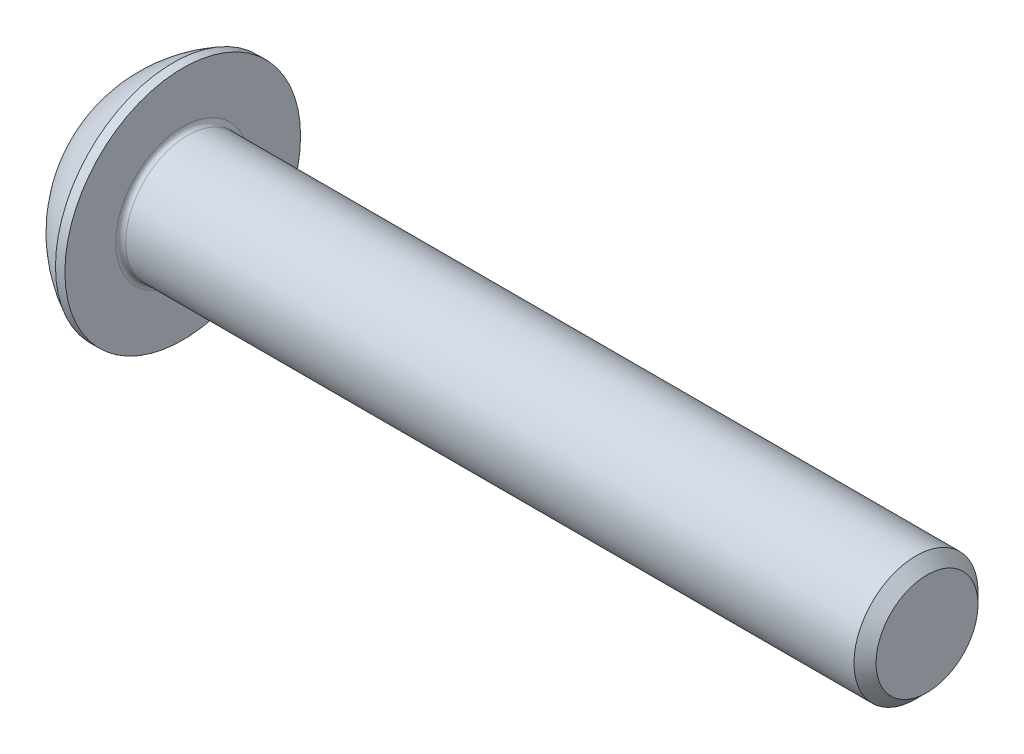
ISO-10303-21;
HEADER;
FILE_DESCRIPTION(('STEP AP214'),'2;1');
FILE_NAME('part.step','',(''),(''),'','','');
FILE_SCHEMA(('AUTOMOTIVE_DESIGN { 1 0 10303 214 1 1 1 1 }'));
ENDSEC;
DATA;
#1=APPLICATION_CONTEXT('core data for automotive mechanical design processes');
#2=APPLICATION_PROTOCOL_DEFINITION('international standard','automotive_design',2000,#1);
#3=PRODUCT_CONTEXT('',#1,'mechanical');
#4=PRODUCT('Part','Part','',(#3));
#5=PRODUCT_RELATED_PRODUCT_CATEGORY('part','',(#4));
#6=PRODUCT_DEFINITION_FORMATION('','',#4);
#7=PRODUCT_DEFINITION_CONTEXT('part definition',#1,'design');
#8=PRODUCT_DEFINITION('design','',#6,#7);
#9=PRODUCT_DEFINITION_SHAPE('','',#8);
#10=(LENGTH_UNIT() NAMED_UNIT(*) SI_UNIT(.MILLI.,.METRE.));
#11=(NAMED_UNIT(*) PLANE_ANGLE_UNIT() SI_UNIT($,.RADIAN.));
#12=(NAMED_UNIT(*) SI_UNIT($,.STERADIAN.) SOLID_ANGLE_UNIT());
#13=UNCERTAINTY_MEASURE_WITH_UNIT(LENGTH_MEASURE(1.E-05),#10,'distance_accuracy_value','');
#14=(GEOMETRIC_REPRESENTATION_CONTEXT(3) GLOBAL_UNCERTAINTY_ASSIGNED_CONTEXT((#13)) GLOBAL_UNIT_ASSIGNED_CONTEXT((#10,
#11,#12)) REPRESENTATION_CONTEXT('',''));
#15=CARTESIAN_POINT('',(0.,0.,0.));
#16=DIRECTION('',(0.,0.,1.));
#17=DIRECTION('',(1.,0.,0.));
#18=AXIS2_PLACEMENT_3D('',#15,#16,#17);
#19=CARTESIAN_POINT('',(0.,0.,0.));
#20=DIRECTION('',(-1.,0.,0.));
#21=DIRECTION('',(0.,0.,1.));
#22=AXIS2_PLACEMENT_3D('',#19,#20,#21);
#23=PLANE('',#22);
#24=CARTESIAN_POINT('',(0.,0.,0.));
#25=DIRECTION('',(-1.,0.,0.));
#26=DIRECTION('',(0.,0.,1.));
#27=AXIS2_PLACEMENT_3D('',#24,#25,#26);
#28=CIRCLE('',#27,2.375);
#29=CARTESIAN_POINT('',(0.,0.,2.375));
#30=VERTEX_POINT('',#29);
#31=EDGE_CURVE('E157',#30,#30,#28,.T.);
#32=ORIENTED_EDGE('',*,*,#31,.T.);
#33=EDGE_LOOP('',(#32));
#34=FACE_BOUND('',#33,.T.);
#35=DIRECTION('',(0.,-1.,0.));
#36=VECTOR('',#35,1.);
#37=CARTESIAN_POINT('',(0.,-0.866025403784438,1.5));
#38=LINE('',#37,#36);
#39=CARTESIAN_POINT('',(0.,0.866025403784439,1.5));
#40=VERTEX_POINT('',#39);
#41=CARTESIAN_POINT('',(0.,-0.866025403784438,1.5));
#42=VERTEX_POINT('',#41);
#43=EDGE_CURVE('E47',#40,#42,#38,.T.);
#44=ORIENTED_EDGE('',*,*,#43,.T.);
#45=DIRECTION('',(0.,-0.5,-0.866025403784439));
#46=VECTOR('',#45,1.);
#47=CARTESIAN_POINT('',(0.,-1.73205080756888,0.));
#48=LINE('',#47,#46);
#49=CARTESIAN_POINT('',(0.,-1.73205080756888,0.));
#50=VERTEX_POINT('',#49);
#51=EDGE_CURVE('E250',#42,#50,#48,.T.);
#52=ORIENTED_EDGE('',*,*,#51,.T.);
#53=DIRECTION('',(0.,0.5,-0.866025403784439));
#54=VECTOR('',#53,1.);
#55=CARTESIAN_POINT('',(0.,-0.866025403784438,-1.5));
#56=LINE('',#55,#54);
#57=CARTESIAN_POINT('',(0.,-0.866025403784438,-1.5));
#58=VERTEX_POINT('',#57);
#59=EDGE_CURVE('E132',#50,#58,#56,.T.);
#60=ORIENTED_EDGE('',*,*,#59,.T.);
#61=DIRECTION('',(0.,1.,0.));
#62=VECTOR('',#61,1.);
#63=CARTESIAN_POINT('',(0.,0.866025403784439,-1.5));
#64=LINE('',#63,#62);
#65=CARTESIAN_POINT('',(0.,0.866025403784439,-1.5));
#66=VERTEX_POINT('',#65);
#67=EDGE_CURVE('E253',#58,#66,#64,.T.);
#68=ORIENTED_EDGE('',*,*,#67,.T.);
#69=DIRECTION('',(0.,0.5,0.866025403784438));
#70=VECTOR('',#69,1.);
#71=CARTESIAN_POINT('',(0.,1.73205080756888,0.));
#72=LINE('',#71,#70);
#73=CARTESIAN_POINT('',(0.,1.73205080756888,0.));
#74=VERTEX_POINT('',#73);
#75=EDGE_CURVE('E255',#66,#74,#72,.T.);
#76=ORIENTED_EDGE('',*,*,#75,.T.);
#77=DIRECTION('',(0.,-0.5,0.866025403784438));
#78=VECTOR('',#77,1.);
#79=CARTESIAN_POINT('',(0.,0.866025403784439,1.5));
#80=LINE('',#79,#78);
#81=EDGE_CURVE('E257',#74,#40,#80,.T.);
#82=ORIENTED_EDGE('',*,*,#81,.T.);
#83=EDGE_LOOP('',(#44,#52,#60,#68,#76,#82));
#84=FACE_BOUND('',#83,.T.);
#85=ADVANCED_FACE('F32',(#34,#84),#23,.T.);
#86=CARTESIAN_POINT('',(4.75501582278482,0.,0.));
#87=DIRECTION('',(-1.,0.,0.));
#88=DIRECTION('',(0.,1.,0.));
#89=AXIS2_PLACEMENT_3D('',#86,#87,#88);
#90=SPHERICAL_SURFACE('',#89,5.3151482081814);
#91=CARTESIAN_POINT('',(2.37,0.,0.));
#92=DIRECTION('',(-1.,0.,0.));
#93=DIRECTION('',(0.,0.,1.));
#94=AXIS2_PLACEMENT_3D('',#91,#92,#93);
#95=CIRCLE('',#94,4.75);
#96=CARTESIAN_POINT('',(2.37,0.,4.75));
#97=VERTEX_POINT('',#96);
#98=EDGE_CURVE('E154',#97,#97,#95,.T.);
#99=ORIENTED_EDGE('',*,*,#98,.T.);
#100=EDGE_LOOP('',(#99));
#101=FACE_BOUND('',#100,.T.);
#102=ORIENTED_EDGE('',*,*,#31,.F.);
#103=EDGE_LOOP('',(#102));
#104=FACE_BOUND('',#103,.T.);
#105=ADVANCED_FACE('F178',(#101,#104),#90,.T.);
#106=CARTESIAN_POINT('',(0.,0.,0.));
#107=DIRECTION('',(-1.,0.,0.));
#108=DIRECTION('',(0.,0.,1.));
#109=AXIS2_PLACEMENT_3D('',#106,#107,#108);
#110=CYLINDRICAL_SURFACE('',#109,4.75);
#111=ORIENTED_EDGE('',*,*,#98,.F.);
#112=EDGE_LOOP('',(#111));
#113=FACE_BOUND('',#112,.T.);
#114=CARTESIAN_POINT('',(2.75,0.,0.));
#115=DIRECTION('',(-1.,0.,0.));
#116=DIRECTION('',(0.,0.,1.));
#117=AXIS2_PLACEMENT_3D('',#114,#115,#116);
#118=CIRCLE('',#117,4.75);
#119=CARTESIAN_POINT('',(2.75,0.,4.75));
#120=VERTEX_POINT('',#119);
#121=EDGE_CURVE('E151',#120,#120,#118,.T.);
#122=ORIENTED_EDGE('',*,*,#121,.T.);
#123=EDGE_LOOP('',(#122));
#124=FACE_BOUND('',#123,.T.);
#125=ADVANCED_FACE('F183',(#113,#124),#110,.T.);
#126=CARTESIAN_POINT('',(2.75,2.5,0.));
#127=DIRECTION('',(-1.,0.,0.));
#128=DIRECTION('',(0.,0.,1.));
#129=AXIS2_PLACEMENT_3D('',#126,#127,#128);
#130=PLANE('',#129);
#131=CARTESIAN_POINT('',(2.75,0.,0.));
#132=DIRECTION('',(-1.,0.,0.));
#133=DIRECTION('',(0.,0.,1.));
#134=AXIS2_PLACEMENT_3D('',#131,#132,#133);
#135=CIRCLE('',#134,2.7);
#136=CARTESIAN_POINT('',(2.75,0.,2.7));
#137=VERTEX_POINT('',#136);
#138=EDGE_CURVE('E40',#137,#137,#135,.T.);
#139=ORIENTED_EDGE('',*,*,#138,.T.);
#140=EDGE_LOOP('',(#139));
#141=FACE_BOUND('',#140,.T.);
#142=ORIENTED_EDGE('',*,*,#121,.F.);
#143=EDGE_LOOP('',(#142));
#144=FACE_BOUND('',#143,.T.);
#145=ADVANCED_FACE('F162',(#141,#144),#130,.F.);
#146=CARTESIAN_POINT('',(0.,0.,0.));
#147=DIRECTION('',(-1.,0.,0.));
#148=DIRECTION('',(0.,0.,1.));
#149=AXIS2_PLACEMENT_3D('',#146,#147,#148);
#150=CYLINDRICAL_SURFACE('',#149,2.5);
#151=CARTESIAN_POINT('',(2.95,0.,0.));
#152=DIRECTION('',(-1.,0.,0.));
#153=DIRECTION('',(0.,0.,1.));
#154=AXIS2_PLACEMENT_3D('',#151,#152,#153);
#155=CIRCLE('',#154,2.5);
#156=CARTESIAN_POINT('',(2.95,0.,2.5));
#157=VERTEX_POINT('',#156);
#158=EDGE_CURVE('E11',#157,#157,#155,.F.);
#159=ORIENTED_EDGE('',*,*,#158,.T.);
#160=EDGE_LOOP('',(#159));
#161=FACE_BOUND('',#160,.T.);
#162=CARTESIAN_POINT('',(32.305,0.,0.));
#163=DIRECTION('',(-1.,0.,0.));
#164=DIRECTION('',(0.,0.,1.));
#165=AXIS2_PLACEMENT_3D('',#162,#163,#164);
#166=CIRCLE('',#165,2.5);
#167=CARTESIAN_POINT('',(32.305,0.,2.5));
#168=VERTEX_POINT('',#167);
#169=EDGE_CURVE('E148',#168,#168,#166,.T.);
#170=ORIENTED_EDGE('',*,*,#169,.T.);
#171=EDGE_LOOP('',(#170));
#172=FACE_BOUND('',#171,.T.);
#173=ADVANCED_FACE('F192',(#161,#172),#150,.T.);
#174=CARTESIAN_POINT('',(32.75,0.,0.));
#175=DIRECTION('',(-1.,0.,0.));
#176=DIRECTION('',(0.,0.,1.));
#177=AXIS2_PLACEMENT_3D('',#174,#175,#176);
#178=CONICAL_SURFACE('',#177,2.055,0.785398163397439);
#179=ORIENTED_EDGE('',*,*,#169,.F.);
#180=EDGE_LOOP('',(#179));
#181=FACE_BOUND('',#180,.T.);
#182=CARTESIAN_POINT('',(32.75,0.,0.));
#183=DIRECTION('',(-1.,0.,0.));
#184=DIRECTION('',(0.,0.,1.));
#185=AXIS2_PLACEMENT_3D('',#182,#183,#184);
#186=CIRCLE('',#185,2.055);
#187=CARTESIAN_POINT('',(32.75,0.,2.055));
#188=VERTEX_POINT('',#187);
#189=EDGE_CURVE('E144',#188,#188,#186,.T.);
#190=ORIENTED_EDGE('',*,*,#189,.T.);
#191=EDGE_LOOP('',(#190));
#192=FACE_BOUND('',#191,.T.);
#193=ADVANCED_FACE('F173',(#181,#192),#178,.T.);
#194=CARTESIAN_POINT('',(32.75,0.,0.));
#195=DIRECTION('',(-1.,0.,0.));
#196=DIRECTION('',(0.,0.,1.));
#197=AXIS2_PLACEMENT_3D('',#194,#195,#196);
#198=PLANE('',#197);
#199=ORIENTED_EDGE('',*,*,#189,.F.);
#200=EDGE_LOOP('',(#199));
#201=FACE_BOUND('',#200,.T.);
#202=ADVANCED_FACE('F166',(#201),#198,.F.);
#203=CARTESIAN_POINT('',(2.95,0.,0.));
#204=DIRECTION('',(-1.,0.,0.));
#205=DIRECTION('',(0.,0.,1.));
#206=AXIS2_PLACEMENT_3D('',#203,#204,#205);
#207=TOROIDAL_SURFACE('',#206,2.7,0.2);
#208=ORIENTED_EDGE('',*,*,#158,.F.);
#209=EDGE_LOOP('',(#208));
#210=FACE_BOUND('',#209,.T.);
#211=ORIENTED_EDGE('',*,*,#138,.F.);
#212=EDGE_LOOP('',(#211));
#213=FACE_BOUND('',#212,.T.);
#214=ADVANCED_FACE('F34',(#210,#213),#207,.F.);
#215=CARTESIAN_POINT('',(1.56,-1.73205080756888,0.));
#216=DIRECTION('',(0.,0.866025403784438,-0.5));
#217=DIRECTION('',(0.,0.5,0.866025403784439));
#218=AXIS2_PLACEMENT_3D('',#215,#216,#217);
#219=PLANE('',#218);
#220=DIRECTION('',(0.,-0.5,-0.866025403784439));
#221=VECTOR('',#220,1.);
#222=CARTESIAN_POINT('',(1.56,-1.73205080756888,0.));
#223=LINE('',#222,#221);
#224=CARTESIAN_POINT('',(1.56,-0.866025403784438,1.5));
#225=VERTEX_POINT('',#224);
#226=CARTESIAN_POINT('',(1.56,-1.29903810567666,0.75));
#227=VERTEX_POINT('',#226);
#228=EDGE_CURVE('E115',#225,#227,#223,.T.);
#229=ORIENTED_EDGE('',*,*,#228,.T.);
#230=CARTESIAN_POINT('',(1.56,-1.73205080756888,0.));
#231=VERTEX_POINT('',#230);
#232=EDGE_CURVE('E108',#227,#231,#223,.T.);
#233=ORIENTED_EDGE('',*,*,#232,.T.);
#234=DIRECTION('',(-1.,0.,0.));
#235=VECTOR('',#234,1.);
#236=CARTESIAN_POINT('',(1.56,-1.73205080756888,0.));
#237=LINE('',#236,#235);
#238=EDGE_CURVE('E112',#231,#50,#237,.T.);
#239=ORIENTED_EDGE('',*,*,#238,.T.);
#240=ORIENTED_EDGE('',*,*,#51,.F.);
#241=DIRECTION('',(-1.,0.,0.));
#242=VECTOR('',#241,1.);
#243=CARTESIAN_POINT('',(1.56,-0.866025403784438,1.5));
#244=LINE('',#243,#242);
#245=EDGE_CURVE('E240',#225,#42,#244,.T.);
#246=ORIENTED_EDGE('',*,*,#245,.F.);
#247=EDGE_LOOP('',(#229,#233,#239,#240,#246));
#248=FACE_BOUND('',#247,.T.);
#249=ADVANCED_FACE('F110',(#248),#219,.T.);
#250=CARTESIAN_POINT('',(1.56,-0.866025403784438,-1.5));
#251=DIRECTION('',(0.,0.866025403784438,0.5));
#252=DIRECTION('',(0.,-0.5,0.866025403784439));
#253=AXIS2_PLACEMENT_3D('',#250,#251,#252);
#254=PLANE('',#253);
#255=DIRECTION('',(0.,0.5,-0.866025403784439));
#256=VECTOR('',#255,1.);
#257=CARTESIAN_POINT('',(1.56,-0.866025403784438,-1.5));
#258=LINE('',#257,#256);
#259=CARTESIAN_POINT('',(1.56,-1.29903810567666,-0.75));
#260=VERTEX_POINT('',#259);
#261=EDGE_CURVE('E120',#231,#260,#258,.T.);
#262=ORIENTED_EDGE('',*,*,#261,.T.);
#263=CARTESIAN_POINT('',(1.56,-0.866025403784438,-1.5));
#264=VERTEX_POINT('',#263);
#265=EDGE_CURVE('E127',#260,#264,#258,.T.);
#266=ORIENTED_EDGE('',*,*,#265,.T.);
#267=DIRECTION('',(-1.,0.,0.));
#268=VECTOR('',#267,1.);
#269=CARTESIAN_POINT('',(1.56,-0.866025403784438,-1.5));
#270=LINE('',#269,#268);
#271=EDGE_CURVE('E134',#264,#58,#270,.T.);
#272=ORIENTED_EDGE('',*,*,#271,.T.);
#273=ORIENTED_EDGE('',*,*,#59,.F.);
#274=ORIENTED_EDGE('',*,*,#238,.F.);
#275=EDGE_LOOP('',(#262,#266,#272,#273,#274));
#276=FACE_BOUND('',#275,.T.);
#277=ADVANCED_FACE('F130',(#276),#254,.T.);
#278=CARTESIAN_POINT('',(1.56,0.866025403784439,-1.5));
#279=DIRECTION('',(0.,0.,1.));
#280=DIRECTION('',(1.,0.,0.));
#281=AXIS2_PLACEMENT_3D('',#278,#279,#280);
#282=PLANE('',#281);
#283=DIRECTION('',(0.,1.,0.));
#284=VECTOR('',#283,1.);
#285=CARTESIAN_POINT('',(1.56,0.866025403784439,-1.5));
#286=LINE('',#285,#284);
#287=CARTESIAN_POINT('',(1.56,0.,-1.5));
#288=VERTEX_POINT('',#287);
#289=EDGE_CURVE('E276',#264,#288,#286,.T.);
#290=ORIENTED_EDGE('',*,*,#289,.T.);
#291=CARTESIAN_POINT('',(1.56,0.866025403784439,-1.5));
#292=VERTEX_POINT('',#291);
#293=EDGE_CURVE('E126',#288,#292,#286,.T.);
#294=ORIENTED_EDGE('',*,*,#293,.T.);
#295=DIRECTION('',(-1.,0.,0.));
#296=VECTOR('',#295,1.);
#297=CARTESIAN_POINT('',(1.56,0.866025403784439,-1.5));
#298=LINE('',#297,#296);
#299=EDGE_CURVE('E139',#292,#66,#298,.T.);
#300=ORIENTED_EDGE('',*,*,#299,.T.);
#301=ORIENTED_EDGE('',*,*,#67,.F.);
#302=ORIENTED_EDGE('',*,*,#271,.F.);
#303=EDGE_LOOP('',(#290,#294,#300,#301,#302));
#304=FACE_BOUND('',#303,.T.);
#305=ADVANCED_FACE('F206',(#304),#282,.T.);
#306=CARTESIAN_POINT('',(1.56,1.73205080756888,0.));
#307=DIRECTION('',(0.,-0.866025403784438,0.5));
#308=DIRECTION('',(0.,-0.5,-0.866025403784439));
#309=AXIS2_PLACEMENT_3D('',#306,#307,#308);
#310=PLANE('',#309);
#311=DIRECTION('',(0.,0.5,0.866025403784438));
#312=VECTOR('',#311,1.);
#313=CARTESIAN_POINT('',(1.56,1.73205080756888,0.));
#314=LINE('',#313,#312);
#315=CARTESIAN_POINT('',(1.56,1.29903810567666,-0.750000000000001));
#316=VERTEX_POINT('',#315);
#317=EDGE_CURVE('E282',#292,#316,#314,.T.);
#318=ORIENTED_EDGE('',*,*,#317,.T.);
#319=CARTESIAN_POINT('',(1.56,1.73205080756888,0.));
#320=VERTEX_POINT('',#319);
#321=EDGE_CURVE('E280',#316,#320,#314,.T.);
#322=ORIENTED_EDGE('',*,*,#321,.T.);
#323=DIRECTION('',(-1.,0.,0.));
#324=VECTOR('',#323,1.);
#325=CARTESIAN_POINT('',(1.56,1.73205080756888,0.));
#326=LINE('',#325,#324);
#327=EDGE_CURVE('E262',#320,#74,#326,.T.);
#328=ORIENTED_EDGE('',*,*,#327,.T.);
#329=ORIENTED_EDGE('',*,*,#75,.F.);
#330=ORIENTED_EDGE('',*,*,#299,.F.);
#331=EDGE_LOOP('',(#318,#322,#328,#329,#330));
#332=FACE_BOUND('',#331,.T.);
#333=ADVANCED_FACE('F209',(#332),#310,.T.);
#334=CARTESIAN_POINT('',(1.56,0.866025403784439,1.5));
#335=DIRECTION('',(0.,-0.866025403784438,-0.5));
#336=DIRECTION('',(0.,0.5,-0.866025403784439));
#337=AXIS2_PLACEMENT_3D('',#334,#335,#336);
#338=PLANE('',#337);
#339=DIRECTION('',(0.,-0.5,0.866025403784438));
#340=VECTOR('',#339,1.);
#341=CARTESIAN_POINT('',(1.56,0.866025403784439,1.5));
#342=LINE('',#341,#340);
#343=CARTESIAN_POINT('',(1.56,1.29903810567666,0.750000000000001));
#344=VERTEX_POINT('',#343);
#345=EDGE_CURVE('E246',#320,#344,#342,.T.);
#346=ORIENTED_EDGE('',*,*,#345,.T.);
#347=CARTESIAN_POINT('',(1.56,0.866025403784439,1.5));
#348=VERTEX_POINT('',#347);
#349=EDGE_CURVE('E238',#344,#348,#342,.T.);
#350=ORIENTED_EDGE('',*,*,#349,.T.);
#351=DIRECTION('',(-1.,0.,0.));
#352=VECTOR('',#351,1.);
#353=CARTESIAN_POINT('',(1.56,0.866025403784439,1.5));
#354=LINE('',#353,#352);
#355=EDGE_CURVE('E244',#348,#40,#354,.T.);
#356=ORIENTED_EDGE('',*,*,#355,.T.);
#357=ORIENTED_EDGE('',*,*,#81,.F.);
#358=ORIENTED_EDGE('',*,*,#327,.F.);
#359=EDGE_LOOP('',(#346,#350,#356,#357,#358));
#360=FACE_BOUND('',#359,.T.);
#361=ADVANCED_FACE('F213',(#360),#338,.T.);
#362=CARTESIAN_POINT('',(1.56,-0.866025403784438,1.5));
#363=DIRECTION('',(0.,0.,-1.));
#364=DIRECTION('',(-1.,0.,0.));
#365=AXIS2_PLACEMENT_3D('',#362,#363,#364);
#366=PLANE('',#365);
#367=DIRECTION('',(0.,-1.,0.));
#368=VECTOR('',#367,1.);
#369=CARTESIAN_POINT('',(1.56,-0.866025403784438,1.5));
#370=LINE('',#369,#368);
#371=CARTESIAN_POINT('',(1.56,0.,1.5));
#372=VERTEX_POINT('',#371);
#373=EDGE_CURVE('E55',#348,#372,#370,.T.);
#374=ORIENTED_EDGE('',*,*,#373,.T.);
#375=EDGE_CURVE('E241',#372,#225,#370,.T.);
#376=ORIENTED_EDGE('',*,*,#375,.T.);
#377=ORIENTED_EDGE('',*,*,#245,.T.);
#378=ORIENTED_EDGE('',*,*,#43,.F.);
#379=ORIENTED_EDGE('',*,*,#355,.F.);
#380=EDGE_LOOP('',(#374,#376,#377,#378,#379));
#381=FACE_BOUND('',#380,.T.);
#382=ADVANCED_FACE('F217',(#381),#366,.T.);
#383=CARTESIAN_POINT('',(1.56,0.,3.));
#384=DIRECTION('',(-1.,0.,0.));
#385=DIRECTION('',(0.,0.,1.));
#386=AXIS2_PLACEMENT_3D('',#383,#384,#385);
#387=PLANE('',#386);
#388=ORIENTED_EDGE('',*,*,#373,.F.);
#389=ORIENTED_EDGE('',*,*,#349,.F.);
#390=CARTESIAN_POINT('',(1.56,0.,0.));
#391=DIRECTION('',(-1.,0.,0.));
#392=DIRECTION('',(0.,0.,1.));
#393=AXIS2_PLACEMENT_3D('',#390,#391,#392);
#394=CIRCLE('',#393,1.5);
#395=EDGE_CURVE('E138',#372,#344,#394,.T.);
#396=ORIENTED_EDGE('',*,*,#395,.F.);
#397=EDGE_LOOP('',(#388,#389,#396));
#398=FACE_BOUND('',#397,.T.);
#399=ADVANCED_FACE('F221',(#398),#387,.T.);
#400=ORIENTED_EDGE('',*,*,#345,.F.);
#401=ORIENTED_EDGE('',*,*,#321,.F.);
#402=EDGE_CURVE('E145',#344,#316,#394,.T.);
#403=ORIENTED_EDGE('',*,*,#402,.F.);
#404=EDGE_LOOP('',(#400,#401,#403));
#405=FACE_BOUND('',#404,.T.);
#406=ADVANCED_FACE('F229',(#405),#387,.T.);
#407=ORIENTED_EDGE('',*,*,#317,.F.);
#408=ORIENTED_EDGE('',*,*,#293,.F.);
#409=EDGE_CURVE('E287',#316,#288,#394,.T.);
#410=ORIENTED_EDGE('',*,*,#409,.F.);
#411=EDGE_LOOP('',(#407,#408,#410));
#412=FACE_BOUND('',#411,.T.);
#413=ADVANCED_FACE('F234',(#412),#387,.T.);
#414=ORIENTED_EDGE('',*,*,#289,.F.);
#415=ORIENTED_EDGE('',*,*,#265,.F.);
#416=EDGE_CURVE('E279',#288,#260,#394,.T.);
#417=ORIENTED_EDGE('',*,*,#416,.F.);
#418=EDGE_LOOP('',(#414,#415,#417));
#419=FACE_BOUND('',#418,.T.);
#420=ADVANCED_FACE('F227',(#419),#387,.T.);
#421=ORIENTED_EDGE('',*,*,#261,.F.);
#422=ORIENTED_EDGE('',*,*,#232,.F.);
#423=EDGE_CURVE('E122',#260,#227,#394,.T.);
#424=ORIENTED_EDGE('',*,*,#423,.F.);
#425=EDGE_LOOP('',(#421,#422,#424));
#426=FACE_BOUND('',#425,.T.);
#427=ADVANCED_FACE('F121',(#426),#387,.T.);
#428=ORIENTED_EDGE('',*,*,#228,.F.);
#429=ORIENTED_EDGE('',*,*,#375,.F.);
#430=EDGE_CURVE('E133',#227,#372,#394,.T.);
#431=ORIENTED_EDGE('',*,*,#430,.F.);
#432=EDGE_LOOP('',(#428,#429,#431));
#433=FACE_BOUND('',#432,.T.);
#434=ADVANCED_FACE('F201',(#433),#387,.T.);
#435=CARTESIAN_POINT('',(2.42602540378445,0.,0.));
#436=DIRECTION('',(-1.,0.,0.));
#437=DIRECTION('',(0.,0.,1.));
#438=AXIS2_PLACEMENT_3D('',#435,#436,#437);
#439=CONICAL_SURFACE('',#438,0.,1.04719755119659);
#440=ORIENTED_EDGE('',*,*,#395,.T.);
#441=ORIENTED_EDGE('',*,*,#402,.T.);
#442=ORIENTED_EDGE('',*,*,#409,.T.);
#443=ORIENTED_EDGE('',*,*,#416,.T.);
#444=ORIENTED_EDGE('',*,*,#423,.T.);
#445=ORIENTED_EDGE('',*,*,#430,.T.);
#446=EDGE_LOOP('',(#440,#441,#442,#443,#444,#445));
#447=FACE_BOUND('',#446,.T.);
#448=CARTESIAN_POINT('',(2.42602540378445,0.,0.));
#449=VERTEX_POINT('',#448);
#450=VERTEX_LOOP('',#449);
#451=FACE_BOUND('',#450,.T.);
#452=ADVANCED_FACE('F199',(#447,#451),#439,.F.);
#453=CLOSED_SHELL('',(#85,#105,#125,#145,#173,#193,#202,#214,#249,#277,#305,#333,#361,#382,#399,
#406,#413,#420,#427,#434,#452));
#454=MANIFOLD_SOLID_BREP('B2',#453);
#455=ADVANCED_BREP_SHAPE_REPRESENTATION('',(#18,#454),#14);
#456=SHAPE_DEFINITION_REPRESENTATION(#9,#455);
ENDSEC;
END-ISO-10303-21;
